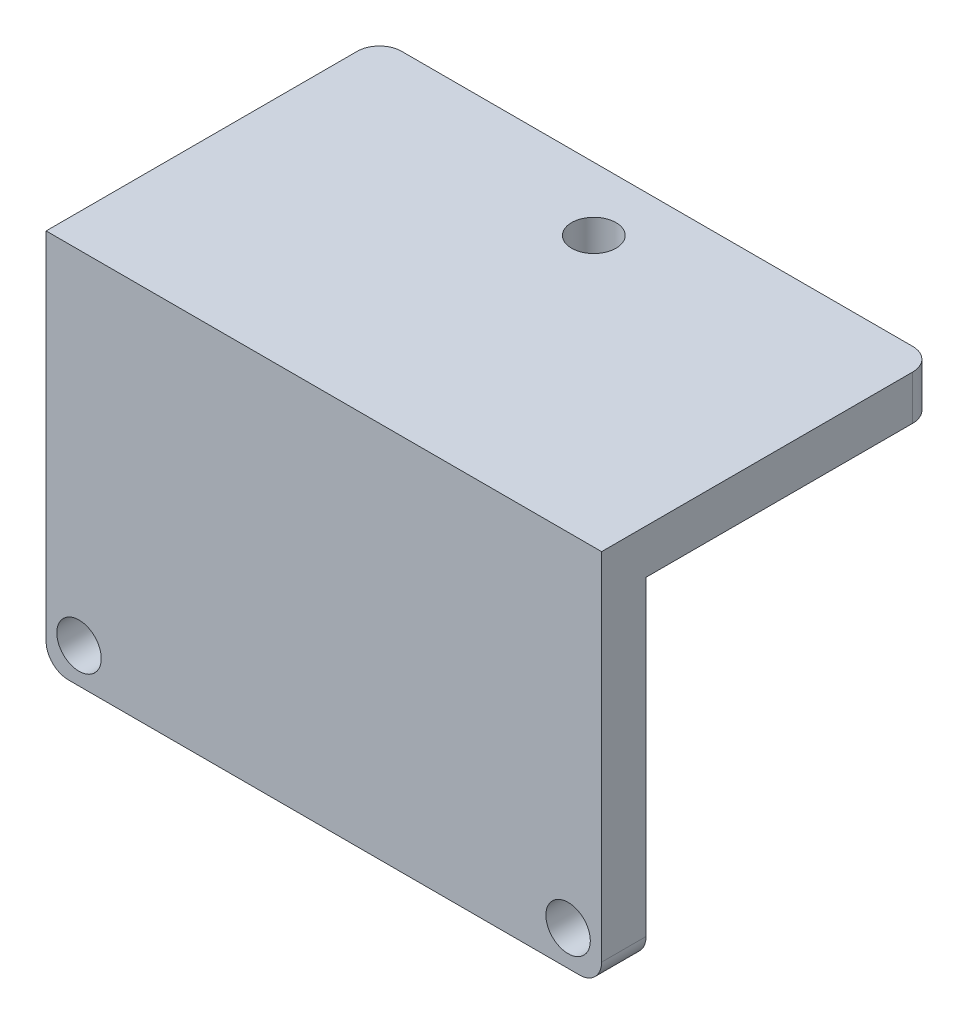
ISO-10303-21;
HEADER;
FILE_DESCRIPTION(('STEP AP214'),'2;1');
FILE_NAME('part.step','',(''),(''),'','','');
FILE_SCHEMA(('AUTOMOTIVE_DESIGN { 1 0 10303 214 1 1 1 1 }'));
ENDSEC;
DATA;
#1=APPLICATION_CONTEXT('core data for automotive mechanical design processes');
#2=APPLICATION_PROTOCOL_DEFINITION('international standard','automotive_design',2000,#1);
#3=PRODUCT_CONTEXT('',#1,'mechanical');
#4=PRODUCT('Part','Part','',(#3));
#5=PRODUCT_RELATED_PRODUCT_CATEGORY('part','',(#4));
#6=PRODUCT_DEFINITION_FORMATION('','',#4);
#7=PRODUCT_DEFINITION_CONTEXT('part definition',#1,'design');
#8=PRODUCT_DEFINITION('design','',#6,#7);
#9=PRODUCT_DEFINITION_SHAPE('','',#8);
#10=(LENGTH_UNIT() NAMED_UNIT(*) SI_UNIT(.MILLI.,.METRE.));
#11=(NAMED_UNIT(*) PLANE_ANGLE_UNIT() SI_UNIT($,.RADIAN.));
#12=(NAMED_UNIT(*) SI_UNIT($,.STERADIAN.) SOLID_ANGLE_UNIT());
#13=UNCERTAINTY_MEASURE_WITH_UNIT(LENGTH_MEASURE(1.E-05),#10,'distance_accuracy_value','');
#14=(GEOMETRIC_REPRESENTATION_CONTEXT(3) GLOBAL_UNCERTAINTY_ASSIGNED_CONTEXT((#13)) GLOBAL_UNIT_ASSIGNED_CONTEXT((#10,
#11,#12)) REPRESENTATION_CONTEXT('',''));
#15=CARTESIAN_POINT('',(0.,0.,0.));
#16=DIRECTION('',(0.,0.,1.));
#17=DIRECTION('',(1.,0.,0.));
#18=AXIS2_PLACEMENT_3D('',#15,#16,#17);
#19=CARTESIAN_POINT('',(0.,0.,2.));
#20=DIRECTION('',(0.,0.,-1.));
#21=DIRECTION('',(-1.,0.,0.));
#22=AXIS2_PLACEMENT_3D('',#19,#20,#21);
#23=PLANE('',#22);
#24=DIRECTION('',(0.,-1.,0.));
#25=VECTOR('',#24,1.);
#26=CARTESIAN_POINT('',(-25.,0.,2.));
#27=LINE('',#26,#25);
#28=CARTESIAN_POINT('',(-25.,2.,2.));
#29=VERTEX_POINT('',#28);
#30=CARTESIAN_POINT('',(-25.,-14.,2.));
#31=VERTEX_POINT('',#30);
#32=EDGE_CURVE('E137',#29,#31,#27,.T.);
#33=ORIENTED_EDGE('',*,*,#32,.T.);
#34=CARTESIAN_POINT('',(-25.,-14.,2.));
#35=CARTESIAN_POINT('',(-24.9999997996185,-14.028134745567,2.));
#36=CARTESIAN_POINT('',(-24.9988119032098,-14.0562560017053,2.));
#37=CARTESIAN_POINT('',(-24.9940728849558,-14.1122973163283,2.));
#38=CARTESIAN_POINT('',(-24.9905218736389,-14.1402173841614,2.));
#39=CARTESIAN_POINT('',(-24.9763578457215,-14.2233269372849,2.));
#40=CARTESIAN_POINT('',(-24.9622337417672,-14.2779597520746,2.));
#41=CARTESIAN_POINT('',(-24.9250149037354,-14.3840769200263,2.));
#42=CARTESIAN_POINT('',(-24.9019158622525,-14.4355597476392,2.));
#43=CARTESIAN_POINT('',(-24.8474030418845,-14.5339160760032,2.));
#44=CARTESIAN_POINT('',(-24.8159907277454,-14.5807903867524,2.));
#45=CARTESIAN_POINT('',(-24.7457470917003,-14.6685994578614,2.));
#46=CARTESIAN_POINT('',(-24.7069150570088,-14.7095336469101,2.));
#47=CARTESIAN_POINT('',(-24.6229041961312,-14.7843139872613,2.));
#48=CARTESIAN_POINT('',(-24.5777254722674,-14.8181602528144,2.));
#49=CARTESIAN_POINT('',(-24.5062109947204,-14.8628702542628,2.));
#50=CARTESIAN_POINT('',(-24.4817269025462,-14.8767725615212,2.));
#51=CARTESIAN_POINT('',(-24.4316995735737,-14.9024553813564,2.));
#52=CARTESIAN_POINT('',(-24.4061572983413,-14.9142377704311,2.));
#53=CARTESIAN_POINT('',(-24.3281796273028,-14.9462808360317,2.));
#54=CARTESIAN_POINT('',(-24.2743436000231,-14.9632684766767,2.));
#55=CARTESIAN_POINT('',(-24.1834905911766,-14.9837173856166,2.));
#56=CARTESIAN_POINT('',(-24.147036002075,-14.9898193941278,2.));
#57=CARTESIAN_POINT('',(-24.0737283254992,-14.9979590428387,2.));
#58=CARTESIAN_POINT('',(-24.0368758777553,-15.0000024450033,2.));
#59=CARTESIAN_POINT('',(-24.,-15.,2.));
#60=B_SPLINE_CURVE_WITH_KNOTS('',3,(#34,#35,#36,#37,#38,#39,#40,#41,#42,#43,#44,#45,#46,#47,#48,
#49,#50,#51,#52,#53,#54,#55,#56,#57,#58,#59),.UNSPECIFIED.,.F.,.F.,(4,2,2,2,2,2,2,2,2,2,2,2,4),
(0.,0.0843523719680451,0.168700798857648,0.33711930117993,0.50561873383297,0.674088497696919,
0.842574453982343,1.01105769422312,1.09543727445699,1.179741792573,1.34817695086741,
1.45885920377357,1.56938420949917),.UNSPECIFIED.);
#61=CARTESIAN_POINT('',(-24.,-15.,2.));
#62=VERTEX_POINT('',#61);
#63=EDGE_CURVE('E313',#31,#62,#60,.T.);
#64=ORIENTED_EDGE('',*,*,#63,.T.);
#65=DIRECTION('',(1.,0.,0.));
#66=VECTOR('',#65,1.);
#67=CARTESIAN_POINT('',(0.,-15.,2.));
#68=LINE('',#67,#66);
#69=CARTESIAN_POINT('',(-0.999999999999998,-15.,2.));
#70=VERTEX_POINT('',#69);
#71=EDGE_CURVE('E144',#62,#70,#68,.T.);
#72=ORIENTED_EDGE('',*,*,#71,.T.);
#73=CARTESIAN_POINT('',(-0.999999999999998,-15.,2.));
#74=CARTESIAN_POINT('',(-0.97186525443297,-14.9999997996185,2.));
#75=CARTESIAN_POINT('',(-0.943743998294749,-14.9988119032098,2.));
#76=CARTESIAN_POINT('',(-0.887702683671729,-14.9940728849558,2.));
#77=CARTESIAN_POINT('',(-0.859782615838623,-14.9905218736389,2.));
#78=CARTESIAN_POINT('',(-0.776673062715144,-14.9763578457214,2.));
#79=CARTESIAN_POINT('',(-0.722040247925385,-14.9622337417672,2.));
#80=CARTESIAN_POINT('',(-0.615923079973703,-14.9250149037354,2.));
#81=CARTESIAN_POINT('',(-0.56444025236083,-14.9019158622525,2.));
#82=CARTESIAN_POINT('',(-0.466083923996784,-14.8474030418845,2.));
#83=CARTESIAN_POINT('',(-0.419209613247622,-14.8159907277453,2.));
#84=CARTESIAN_POINT('',(-0.331400542138594,-14.7457470917003,2.));
#85=CARTESIAN_POINT('',(-0.290466353089881,-14.7069150570088,2.));
#86=CARTESIAN_POINT('',(-0.215686012738719,-14.6229041961312,2.));
#87=CARTESIAN_POINT('',(-0.181839747185592,-14.5777254722674,2.));
#88=CARTESIAN_POINT('',(-0.137129745737251,-14.5062109947204,2.));
#89=CARTESIAN_POINT('',(-0.123227438478842,-14.4817269025462,2.));
#90=CARTESIAN_POINT('',(-0.0975446186435505,-14.4316995735737,2.));
#91=CARTESIAN_POINT('',(-0.08576222956887,-14.4061572983413,2.));
#92=CARTESIAN_POINT('',(-0.0537191639682927,-14.3281796273028,2.));
#93=CARTESIAN_POINT('',(-0.0367315233233388,-14.2743436000231,2.));
#94=CARTESIAN_POINT('',(-0.0162826143833987,-14.1834905911766,2.));
#95=CARTESIAN_POINT('',(-0.0101806058722224,-14.147036002075,2.));
#96=CARTESIAN_POINT('',(-0.00204095716132224,-14.0737283254992,2.));
#97=CARTESIAN_POINT('',(2.44500328721798E-06,-14.0368758777553,2.));
#98=CARTESIAN_POINT('',(0.,-14.,2.));
#99=B_SPLINE_CURVE_WITH_KNOTS('',3,(#73,#74,#75,#76,#77,#78,#79,#80,#81,#82,#83,#84,#85,#86,#87,
#88,#89,#90,#91,#92,#93,#94,#95,#96,#97,#98),.UNSPECIFIED.,.F.,.F.,(4,2,2,2,2,2,2,2,2,2,2,2,4),
(0.,0.0843523719680458,0.168700798857649,0.33711930117993,0.505618733832968,0.67408849769692,
0.842574453982342,1.01105769422312,1.09543727445699,1.17974179257301,1.34817695086743,
1.45885920377359,1.56938420949918),.UNSPECIFIED.);
#100=CARTESIAN_POINT('',(0.,-14.,2.));
#101=VERTEX_POINT('',#100);
#102=EDGE_CURVE('E253',#70,#101,#99,.T.);
#103=ORIENTED_EDGE('',*,*,#102,.T.);
#104=DIRECTION('',(0.,1.,0.));
#105=VECTOR('',#104,1.);
#106=CARTESIAN_POINT('',(0.,0.,2.));
#107=LINE('',#106,#105);
#108=CARTESIAN_POINT('',(0.,2.,2.));
#109=VERTEX_POINT('',#108);
#110=EDGE_CURVE('E145',#101,#109,#107,.T.);
#111=ORIENTED_EDGE('',*,*,#110,.T.);
#112=DIRECTION('',(1.,0.,0.));
#113=VECTOR('',#112,1.);
#114=CARTESIAN_POINT('',(-25.,2.,2.));
#115=LINE('',#114,#113);
#116=EDGE_CURVE('E128',#29,#109,#115,.T.);
#117=ORIENTED_EDGE('',*,*,#116,.F.);
#118=EDGE_LOOP('',(#33,#64,#72,#103,#111,#117));
#119=FACE_BOUND('',#118,.T.);
#120=CARTESIAN_POINT('',(-23.5193155415756,-13.4230684262862,2.));
#121=DIRECTION('',(0.,0.,1.));
#122=DIRECTION('',(1.,0.,0.));
#123=AXIS2_PLACEMENT_3D('',#120,#121,#122);
#124=CIRCLE('',#123,1.);
#125=CARTESIAN_POINT('',(-22.5193155415756,-13.4230684262862,2.));
#126=VERTEX_POINT('',#125);
#127=EDGE_CURVE('E169',#126,#126,#124,.T.);
#128=ORIENTED_EDGE('',*,*,#127,.F.);
#129=EDGE_LOOP('',(#128));
#130=FACE_BOUND('',#129,.T.);
#131=CARTESIAN_POINT('',(-1.50821061141534,-13.4230684262862,2.));
#132=DIRECTION('',(0.,0.,1.));
#133=DIRECTION('',(1.,0.,0.));
#134=AXIS2_PLACEMENT_3D('',#131,#132,#133);
#135=CIRCLE('',#134,1.);
#136=CARTESIAN_POINT('',(-0.508210611415337,-13.4230684262862,2.));
#137=VERTEX_POINT('',#136);
#138=EDGE_CURVE('E163',#137,#137,#135,.T.);
#139=ORIENTED_EDGE('',*,*,#138,.F.);
#140=EDGE_LOOP('',(#139));
#141=FACE_BOUND('',#140,.T.);
#142=ADVANCED_FACE('F38',(#119,#130,#141),#23,.F.);
#143=CARTESIAN_POINT('',(0.,0.,0.));
#144=DIRECTION('',(0.,0.,-1.));
#145=DIRECTION('',(-1.,0.,0.));
#146=AXIS2_PLACEMENT_3D('',#143,#144,#145);
#147=PLANE('',#146);
#148=CARTESIAN_POINT('',(-23.5193155415756,-13.4230684262862,0.));
#149=DIRECTION('',(0.,0.,1.));
#150=DIRECTION('',(1.,0.,0.));
#151=AXIS2_PLACEMENT_3D('',#148,#149,#150);
#152=CIRCLE('',#151,1.);
#153=CARTESIAN_POINT('',(-22.5193155415756,-13.4230684262862,0.));
#154=VERTEX_POINT('',#153);
#155=EDGE_CURVE('E166',#154,#154,#152,.T.);
#156=ORIENTED_EDGE('',*,*,#155,.T.);
#157=EDGE_LOOP('',(#156));
#158=FACE_BOUND('',#157,.T.);
#159=DIRECTION('',(1.,0.,0.));
#160=VECTOR('',#159,1.);
#161=CARTESIAN_POINT('',(0.,-15.,0.));
#162=LINE('',#161,#160);
#163=CARTESIAN_POINT('',(-24.,-15.,0.));
#164=VERTEX_POINT('',#163);
#165=CARTESIAN_POINT('',(-0.999999999999998,-15.,0.));
#166=VERTEX_POINT('',#165);
#167=EDGE_CURVE('E175',#164,#166,#162,.T.);
#168=ORIENTED_EDGE('',*,*,#167,.F.);
#169=CARTESIAN_POINT('',(-24.,-15.,0.));
#170=CARTESIAN_POINT('',(-24.028134745567,-14.9999997996185,0.));
#171=CARTESIAN_POINT('',(-24.0562560017053,-14.9988119032098,0.));
#172=CARTESIAN_POINT('',(-24.1122973163283,-14.9940728849558,0.));
#173=CARTESIAN_POINT('',(-24.1402173841614,-14.9905218736389,0.));
#174=CARTESIAN_POINT('',(-24.2233269372849,-14.9763578457214,0.));
#175=CARTESIAN_POINT('',(-24.2779597520746,-14.9622337417672,0.));
#176=CARTESIAN_POINT('',(-24.3840769200263,-14.9250149037354,0.));
#177=CARTESIAN_POINT('',(-24.4355597476392,-14.9019158622525,0.));
#178=CARTESIAN_POINT('',(-24.5339160760032,-14.8474030418845,0.));
#179=CARTESIAN_POINT('',(-24.5807903867524,-14.8159907277453,0.));
#180=CARTESIAN_POINT('',(-24.6685994578614,-14.7457470917003,0.));
#181=CARTESIAN_POINT('',(-24.7095336469101,-14.7069150570088,0.));
#182=CARTESIAN_POINT('',(-24.7843139872613,-14.6229041961312,0.));
#183=CARTESIAN_POINT('',(-24.8181602528144,-14.5777254722674,0.));
#184=CARTESIAN_POINT('',(-24.8628702542628,-14.5062109947204,0.));
#185=CARTESIAN_POINT('',(-24.8767725615212,-14.4817269025462,0.));
#186=CARTESIAN_POINT('',(-24.9024553813565,-14.4316995735737,0.));
#187=CARTESIAN_POINT('',(-24.9142377704311,-14.4061572983413,0.));
#188=CARTESIAN_POINT('',(-24.9462808360317,-14.3281796273028,0.));
#189=CARTESIAN_POINT('',(-24.9632684766767,-14.2743436000231,0.));
#190=CARTESIAN_POINT('',(-24.9837173856166,-14.1834905911766,0.));
#191=CARTESIAN_POINT('',(-24.9898193941278,-14.147036002075,0.));
#192=CARTESIAN_POINT('',(-24.9979590428387,-14.0737283254992,0.));
#193=CARTESIAN_POINT('',(-25.0000024450033,-14.0368758777553,0.));
#194=CARTESIAN_POINT('',(-25.,-14.,0.));
#195=B_SPLINE_CURVE_WITH_KNOTS('',3,(#169,#170,#171,#172,#173,#174,#175,#176,#177,#178,#179,
#180,#181,#182,#183,#184,#185,#186,#187,#188,#189,#190,#191,#192,#193,#194),.UNSPECIFIED.,.F.,
.F.,(4,2,2,2,2,2,2,2,2,2,2,2,4),(0.,0.0843523719680469,0.168700798857652,0.337119301179937,
0.50561873383298,0.674088497696934,0.842574453982358,1.01105769422313,1.095437274457,
1.17974179257302,1.34817695086744,1.45885920377359,1.56938420949918),.UNSPECIFIED.);
#196=CARTESIAN_POINT('',(-25.,-14.,0.));
#197=VERTEX_POINT('',#196);
#198=EDGE_CURVE('E210',#164,#197,#195,.T.);
#199=ORIENTED_EDGE('',*,*,#198,.T.);
#200=DIRECTION('',(0.,-1.,0.));
#201=VECTOR('',#200,1.);
#202=CARTESIAN_POINT('',(-25.,0.,0.));
#203=LINE('',#202,#201);
#204=CARTESIAN_POINT('',(-25.,0.,0.));
#205=VERTEX_POINT('',#204);
#206=EDGE_CURVE('E184',#205,#197,#203,.T.);
#207=ORIENTED_EDGE('',*,*,#206,.F.);
#208=DIRECTION('',(-1.,0.,0.));
#209=VECTOR('',#208,1.);
#210=CARTESIAN_POINT('',(0.,0.,0.));
#211=LINE('',#210,#209);
#212=CARTESIAN_POINT('',(0.,0.,0.));
#213=VERTEX_POINT('',#212);
#214=EDGE_CURVE('E181',#213,#205,#211,.T.);
#215=ORIENTED_EDGE('',*,*,#214,.F.);
#216=DIRECTION('',(0.,1.,0.));
#217=VECTOR('',#216,1.);
#218=CARTESIAN_POINT('',(0.,0.,0.));
#219=LINE('',#218,#217);
#220=CARTESIAN_POINT('',(0.,-14.,0.));
#221=VERTEX_POINT('',#220);
#222=EDGE_CURVE('E172',#221,#213,#219,.T.);
#223=ORIENTED_EDGE('',*,*,#222,.F.);
#224=CARTESIAN_POINT('',(0.,-14.,0.));
#225=CARTESIAN_POINT('',(-2.00381546555757E-07,-14.028134745567,0.));
#226=CARTESIAN_POINT('',(-0.00118809679022327,-14.0562560017052,0.));
#227=CARTESIAN_POINT('',(-0.0059271150441788,-14.1122973163283,0.));
#228=CARTESIAN_POINT('',(-0.00947812636110279,-14.1402173841614,0.));
#229=CARTESIAN_POINT('',(-0.0236421542785576,-14.2233269372849,0.));
#230=CARTESIAN_POINT('',(-0.0377662582328379,-14.2779597520746,0.));
#231=CARTESIAN_POINT('',(-0.0749850962645588,-14.3840769200263,0.));
#232=CARTESIAN_POINT('',(-0.0980841377474982,-14.4355597476392,0.));
#233=CARTESIAN_POINT('',(-0.152596958115516,-14.5339160760032,0.));
#234=CARTESIAN_POINT('',(-0.184009272254659,-14.5807903867524,0.));
#235=CARTESIAN_POINT('',(-0.254252908299716,-14.6685994578614,0.));
#236=CARTESIAN_POINT('',(-0.293084942991177,-14.7095336469101,0.));
#237=CARTESIAN_POINT('',(-0.377095803868763,-14.7843139872613,0.));
#238=CARTESIAN_POINT('',(-0.422274527732596,-14.8181602528144,0.));
#239=CARTESIAN_POINT('',(-0.493789005279561,-14.8628702542627,0.));
#240=CARTESIAN_POINT('',(-0.518273097453774,-14.8767725615212,0.));
#241=CARTESIAN_POINT('',(-0.568300426426299,-14.9024553813564,0.));
#242=CARTESIAN_POINT('',(-0.593842701658704,-14.9142377704311,0.));
#243=CARTESIAN_POINT('',(-0.671820372697227,-14.9462808360317,0.));
#244=CARTESIAN_POINT('',(-0.725656399976934,-14.9632684766767,0.));
#245=CARTESIAN_POINT('',(-0.816509408823389,-14.9837173856166,0.));
#246=CARTESIAN_POINT('',(-0.852963997925003,-14.9898193941278,0.));
#247=CARTESIAN_POINT('',(-0.92627167450077,-14.9979590428387,0.));
#248=CARTESIAN_POINT('',(-0.963124122244662,-15.0000024450033,0.));
#249=CARTESIAN_POINT('',(-0.999999999999998,-15.,0.));
#250=B_SPLINE_CURVE_WITH_KNOTS('',3,(#224,#225,#226,#227,#228,#229,#230,#231,#232,#233,#234,
#235,#236,#237,#238,#239,#240,#241,#242,#243,#244,#245,#246,#247,#248,#249),.UNSPECIFIED.,.F.,
.F.,(4,2,2,2,2,2,2,2,2,2,2,2,4),(0.,0.084352371968045,0.168700798857648,0.337119301179932,
0.505618733832971,0.674088497696921,0.842574453982343,1.01105769422312,1.09543727445699,
1.17974179257301,1.34817695086743,1.45885920377358,1.56938420949918),.UNSPECIFIED.);
#251=EDGE_CURVE('E199',#221,#166,#250,.T.);
#252=ORIENTED_EDGE('',*,*,#251,.T.);
#253=EDGE_LOOP('',(#168,#199,#207,#215,#223,#252));
#254=FACE_BOUND('',#253,.T.);
#255=CARTESIAN_POINT('',(-1.50821061141534,-13.4230684262862,0.));
#256=DIRECTION('',(0.,0.,1.));
#257=DIRECTION('',(1.,0.,0.));
#258=AXIS2_PLACEMENT_3D('',#255,#256,#257);
#259=CIRCLE('',#258,1.);
#260=CARTESIAN_POINT('',(-0.508210611415337,-13.4230684262862,0.));
#261=VERTEX_POINT('',#260);
#262=EDGE_CURVE('E156',#261,#261,#259,.T.);
#263=ORIENTED_EDGE('',*,*,#262,.T.);
#264=EDGE_LOOP('',(#263));
#265=FACE_BOUND('',#264,.T.);
#266=ADVANCED_FACE('F217',(#158,#254,#265),#147,.T.);
#267=CARTESIAN_POINT('',(0.,0.,2.));
#268=DIRECTION('',(-1.,0.,0.));
#269=DIRECTION('',(0.,-1.,0.));
#270=AXIS2_PLACEMENT_3D('',#267,#268,#269);
#271=PLANE('',#270);
#272=DIRECTION('',(0.,0.,-1.));
#273=VECTOR('',#272,1.);
#274=CARTESIAN_POINT('',(0.,0.,2.));
#275=LINE('',#274,#273);
#276=CARTESIAN_POINT('',(0.,0.,-12.));
#277=VERTEX_POINT('',#276);
#278=EDGE_CURVE('E159',#213,#277,#275,.T.);
#279=ORIENTED_EDGE('',*,*,#278,.T.);
#280=CARTESIAN_POINT('',(0.,6.,-12.));
#281=CARTESIAN_POINT('',(0.,4.66666666666667,-12.));
#282=CARTESIAN_POINT('',(0.,3.33333333333333,-12.));
#283=CARTESIAN_POINT('',(0.,2.,-12.));
#284=CARTESIAN_POINT('',(0.,1.33333333333333,-12.));
#285=CARTESIAN_POINT('',(0.,0.666666666666667,-12.));
#286=CARTESIAN_POINT('',(0.,0.,-12.));
#287=CARTESIAN_POINT('',(0.,-1.33333333333333,-12.));
#288=CARTESIAN_POINT('',(0.,-2.66666666666667,-12.));
#289=CARTESIAN_POINT('',(0.,-4.,-12.));
#290=(BOUNDED_CURVE() B_SPLINE_CURVE(3,(#280,#281,#282,#283,#284,#285,#286,#287,#288,#289),
.UNSPECIFIED.,.F.,.F.) B_SPLINE_CURVE_WITH_KNOTS((4,3,3,4),(-0.004,0.,0.002,0.006),
.UNSPECIFIED.) CURVE() GEOMETRIC_REPRESENTATION_ITEM() RATIONAL_B_SPLINE_CURVE((1.,1.,1.,1.,1.,
1.,1.,1.,1.,1.)) REPRESENTATION_ITEM(''));
#291=CARTESIAN_POINT('',(0.,2.,-12.));
#292=VERTEX_POINT('',#291);
#293=EDGE_CURVE('E55',#277,#292,#290,.F.);
#294=ORIENTED_EDGE('',*,*,#293,.T.);
#295=DIRECTION('',(0.,0.,-1.));
#296=VECTOR('',#295,1.);
#297=CARTESIAN_POINT('',(0.,2.,2.));
#298=LINE('',#297,#296);
#299=EDGE_CURVE('E149',#109,#292,#298,.T.);
#300=ORIENTED_EDGE('',*,*,#299,.F.);
#301=ORIENTED_EDGE('',*,*,#110,.F.);
#302=CARTESIAN_POINT('',(0.,-14.,6.));
#303=CARTESIAN_POINT('',(0.,-14.,4.66666666666667));
#304=CARTESIAN_POINT('',(0.,-14.,3.33333333333333));
#305=CARTESIAN_POINT('',(0.,-14.,2.));
#306=CARTESIAN_POINT('',(0.,-14.,1.33333333333333));
#307=CARTESIAN_POINT('',(0.,-14.,0.666666666666668));
#308=CARTESIAN_POINT('',(0.,-14.,0.));
#309=CARTESIAN_POINT('',(0.,-14.,-1.33333333333333));
#310=CARTESIAN_POINT('',(0.,-14.,-2.66666666666667));
#311=CARTESIAN_POINT('',(0.,-14.,-4.));
#312=(BOUNDED_CURVE() B_SPLINE_CURVE(3,(#302,#303,#304,#305,#306,#307,#308,#309,#310,#311),
.UNSPECIFIED.,.F.,.F.) B_SPLINE_CURVE_WITH_KNOTS((4,3,3,4),(-0.004,0.,0.002,0.006),
.UNSPECIFIED.) CURVE() GEOMETRIC_REPRESENTATION_ITEM() RATIONAL_B_SPLINE_CURVE((1.,1.,1.,1.,1.,
1.,1.,1.,1.,1.)) REPRESENTATION_ITEM(''));
#313=EDGE_CURVE('E387',#101,#221,#312,.T.);
#314=ORIENTED_EDGE('',*,*,#313,.T.);
#315=ORIENTED_EDGE('',*,*,#222,.T.);
#316=EDGE_LOOP('',(#279,#294,#300,#301,#314,#315));
#317=FACE_BOUND('',#316,.T.);
#318=ADVANCED_FACE('F412',(#317),#271,.F.);
#319=CARTESIAN_POINT('',(-25.,0.,2.));
#320=DIRECTION('',(1.,0.,0.));
#321=DIRECTION('',(0.,1.,0.));
#322=AXIS2_PLACEMENT_3D('',#319,#320,#321);
#323=PLANE('',#322);
#324=DIRECTION('',(0.,0.,1.));
#325=VECTOR('',#324,1.);
#326=CARTESIAN_POINT('',(-25.,2.,-13.));
#327=LINE('',#326,#325);
#328=CARTESIAN_POINT('',(-25.,2.,-12.));
#329=VERTEX_POINT('',#328);
#330=EDGE_CURVE('E124',#329,#29,#327,.T.);
#331=ORIENTED_EDGE('',*,*,#330,.F.);
#332=CARTESIAN_POINT('',(-25.,6.,-12.));
#333=CARTESIAN_POINT('',(-25.,4.66666666666667,-12.));
#334=CARTESIAN_POINT('',(-25.,3.33333333333333,-12.));
#335=CARTESIAN_POINT('',(-25.,2.,-12.));
#336=CARTESIAN_POINT('',(-25.,1.33333333333333,-12.));
#337=CARTESIAN_POINT('',(-25.,0.666666666666668,-12.));
#338=CARTESIAN_POINT('',(-25.,0.,-12.));
#339=CARTESIAN_POINT('',(-25.,-1.33333333333333,-12.));
#340=CARTESIAN_POINT('',(-25.,-2.66666666666667,-12.));
#341=CARTESIAN_POINT('',(-25.,-4.,-12.));
#342=(BOUNDED_CURVE() B_SPLINE_CURVE(3,(#332,#333,#334,#335,#336,#337,#338,#339,#340,#341),
.UNSPECIFIED.,.F.,.F.) B_SPLINE_CURVE_WITH_KNOTS((4,3,3,4),(-0.004,0.,0.002,0.006),
.UNSPECIFIED.) CURVE() GEOMETRIC_REPRESENTATION_ITEM() RATIONAL_B_SPLINE_CURVE((1.,1.,1.,1.,1.,
1.,1.,1.,1.,1.)) REPRESENTATION_ITEM(''));
#343=CARTESIAN_POINT('',(-25.,0.,-12.));
#344=VERTEX_POINT('',#343);
#345=EDGE_CURVE('E385',#329,#344,#342,.T.);
#346=ORIENTED_EDGE('',*,*,#345,.T.);
#347=DIRECTION('',(0.,0.,1.));
#348=VECTOR('',#347,1.);
#349=CARTESIAN_POINT('',(-25.,0.,-13.));
#350=LINE('',#349,#348);
#351=EDGE_CURVE('E157',#344,#205,#350,.T.);
#352=ORIENTED_EDGE('',*,*,#351,.T.);
#353=ORIENTED_EDGE('',*,*,#206,.T.);
#354=CARTESIAN_POINT('',(-25.,-14.,6.));
#355=CARTESIAN_POINT('',(-25.,-14.,4.66666666666667));
#356=CARTESIAN_POINT('',(-25.,-14.,3.33333333333333));
#357=CARTESIAN_POINT('',(-25.,-14.,2.));
#358=CARTESIAN_POINT('',(-25.,-14.,1.33333333333333));
#359=CARTESIAN_POINT('',(-25.,-14.,0.666666666666667));
#360=CARTESIAN_POINT('',(-25.,-14.,0.));
#361=CARTESIAN_POINT('',(-25.,-14.,-1.33333333333333));
#362=CARTESIAN_POINT('',(-25.,-14.,-2.66666666666667));
#363=CARTESIAN_POINT('',(-25.,-14.,-4.));
#364=(BOUNDED_CURVE() B_SPLINE_CURVE(3,(#354,#355,#356,#357,#358,#359,#360,#361,#362,#363),
.UNSPECIFIED.,.F.,.F.) B_SPLINE_CURVE_WITH_KNOTS((4,3,3,4),(-0.004,0.,0.002,0.006),
.UNSPECIFIED.) CURVE() GEOMETRIC_REPRESENTATION_ITEM() RATIONAL_B_SPLINE_CURVE((1.,1.,1.,1.,1.,
1.,1.,1.,1.,1.)) REPRESENTATION_ITEM(''));
#365=EDGE_CURVE('E141',#197,#31,#364,.F.);
#366=ORIENTED_EDGE('',*,*,#365,.T.);
#367=ORIENTED_EDGE('',*,*,#32,.F.);
#368=EDGE_LOOP('',(#331,#346,#352,#353,#366,#367));
#369=FACE_BOUND('',#368,.T.);
#370=ADVANCED_FACE('F138',(#369),#323,.F.);
#371=CARTESIAN_POINT('',(0.,-15.,2.));
#372=DIRECTION('',(0.,1.,0.));
#373=DIRECTION('',(-1.,0.,0.));
#374=AXIS2_PLACEMENT_3D('',#371,#372,#373);
#375=PLANE('',#374);
#376=ORIENTED_EDGE('',*,*,#71,.F.);
#377=CARTESIAN_POINT('',(-24.,-15.,6.));
#378=CARTESIAN_POINT('',(-24.,-15.,4.66666666666667));
#379=CARTESIAN_POINT('',(-24.,-15.,3.33333333333333));
#380=CARTESIAN_POINT('',(-24.,-15.,2.));
#381=CARTESIAN_POINT('',(-24.,-15.,1.33333333333333));
#382=CARTESIAN_POINT('',(-24.,-15.,0.666666666666667));
#383=CARTESIAN_POINT('',(-24.,-15.,0.));
#384=CARTESIAN_POINT('',(-24.,-15.,-1.33333333333333));
#385=CARTESIAN_POINT('',(-24.,-15.,-2.66666666666667));
#386=CARTESIAN_POINT('',(-24.,-15.,-4.));
#387=(BOUNDED_CURVE() B_SPLINE_CURVE(3,(#377,#378,#379,#380,#381,#382,#383,#384,#385,#386),
.UNSPECIFIED.,.F.,.F.) B_SPLINE_CURVE_WITH_KNOTS((4,3,3,4),(-0.004,0.,0.002,0.006),
.UNSPECIFIED.) CURVE() GEOMETRIC_REPRESENTATION_ITEM() RATIONAL_B_SPLINE_CURVE((1.,1.,1.,1.,1.,
1.,1.,1.,1.,1.)) REPRESENTATION_ITEM(''));
#388=EDGE_CURVE('E191',#62,#164,#387,.T.);
#389=ORIENTED_EDGE('',*,*,#388,.T.);
#390=ORIENTED_EDGE('',*,*,#167,.T.);
#391=CARTESIAN_POINT('',(-0.999999999999998,-15.,6.));
#392=CARTESIAN_POINT('',(-0.999999999999998,-15.,4.66666666666667));
#393=CARTESIAN_POINT('',(-0.999999999999998,-15.,3.33333333333333));
#394=CARTESIAN_POINT('',(-0.999999999999998,-15.,2.));
#395=CARTESIAN_POINT('',(-0.999999999999998,-15.,1.33333333333333));
#396=CARTESIAN_POINT('',(-0.999999999999998,-15.,0.666666666666667));
#397=CARTESIAN_POINT('',(-0.999999999999998,-15.,0.));
#398=CARTESIAN_POINT('',(-0.999999999999998,-15.,-1.33333333333333));
#399=CARTESIAN_POINT('',(-0.999999999999998,-15.,-2.66666666666667));
#400=CARTESIAN_POINT('',(-0.999999999999998,-15.,-4.));
#401=(BOUNDED_CURVE() B_SPLINE_CURVE(3,(#391,#392,#393,#394,#395,#396,#397,#398,#399,#400),
.UNSPECIFIED.,.F.,.F.) B_SPLINE_CURVE_WITH_KNOTS((4,3,3,4),(-0.004,0.,0.002,0.006),
.UNSPECIFIED.) CURVE() GEOMETRIC_REPRESENTATION_ITEM() RATIONAL_B_SPLINE_CURVE((1.,1.,1.,1.,1.,
1.,1.,1.,1.,1.)) REPRESENTATION_ITEM(''));
#402=EDGE_CURVE('E179',#166,#70,#401,.F.);
#403=ORIENTED_EDGE('',*,*,#402,.T.);
#404=EDGE_LOOP('',(#376,#389,#390,#403));
#405=FACE_BOUND('',#404,.T.);
#406=ADVANCED_FACE('F329',(#405),#375,.F.);
#407=CARTESIAN_POINT('',(-23.5193155415756,-13.4230684262862,2.));
#408=DIRECTION('',(0.,0.,-1.));
#409=DIRECTION('',(-1.,0.,0.));
#410=AXIS2_PLACEMENT_3D('',#407,#408,#409);
#411=CYLINDRICAL_SURFACE('',#410,1.);
#412=ORIENTED_EDGE('',*,*,#127,.T.);
#413=EDGE_LOOP('',(#412));
#414=FACE_BOUND('',#413,.T.);
#415=ORIENTED_EDGE('',*,*,#155,.F.);
#416=EDGE_LOOP('',(#415));
#417=FACE_BOUND('',#416,.T.);
#418=ADVANCED_FACE('F324',(#414,#417),#411,.F.);
#419=CARTESIAN_POINT('',(-1.50821061141534,-13.4230684262862,2.));
#420=DIRECTION('',(0.,0.,-1.));
#421=DIRECTION('',(-1.,0.,0.));
#422=AXIS2_PLACEMENT_3D('',#419,#420,#421);
#423=CYLINDRICAL_SURFACE('',#422,1.);
#424=ORIENTED_EDGE('',*,*,#138,.T.);
#425=EDGE_LOOP('',(#424));
#426=FACE_BOUND('',#425,.T.);
#427=ORIENTED_EDGE('',*,*,#262,.F.);
#428=EDGE_LOOP('',(#427));
#429=FACE_BOUND('',#428,.T.);
#430=ADVANCED_FACE('F328',(#426,#429),#423,.F.);
#431=CARTESIAN_POINT('',(-24.,-15.,2.4));
#432=CARTESIAN_POINT('',(-24.,-15.,2.26666666666667));
#433=CARTESIAN_POINT('',(-24.,-15.,2.13333333333333));
#434=CARTESIAN_POINT('',(-24.,-15.,2.));
#435=CARTESIAN_POINT('',(-24.,-15.,1.33333333333333));
#436=CARTESIAN_POINT('',(-24.,-15.,0.666666666666667));
#437=CARTESIAN_POINT('',(-24.,-15.,0.));
#438=CARTESIAN_POINT('',(-24.,-15.,-0.133333333333333));
#439=CARTESIAN_POINT('',(-24.,-15.,-0.266666666666667));
#440=CARTESIAN_POINT('',(-24.,-15.,-0.4));
#441=CARTESIAN_POINT('',(-25.,-15.,2.4));
#442=CARTESIAN_POINT('',(-25.,-15.,2.26666666666667));
#443=CARTESIAN_POINT('',(-25.,-15.,2.13333333333333));
#444=CARTESIAN_POINT('',(-25.,-15.,2.));
#445=CARTESIAN_POINT('',(-25.,-15.,1.33333333333333));
#446=CARTESIAN_POINT('',(-25.,-15.,0.666666666666667));
#447=CARTESIAN_POINT('',(-25.,-15.,0.));
#448=CARTESIAN_POINT('',(-25.,-15.,-0.133333333333333));
#449=CARTESIAN_POINT('',(-25.,-15.,-0.266666666666667));
#450=CARTESIAN_POINT('',(-25.,-15.,-0.4));
#451=CARTESIAN_POINT('',(-25.,-14.,2.4));
#452=CARTESIAN_POINT('',(-25.,-14.,2.26666666666667));
#453=CARTESIAN_POINT('',(-25.,-14.,2.13333333333333));
#454=CARTESIAN_POINT('',(-25.,-14.,2.));
#455=CARTESIAN_POINT('',(-25.,-14.,1.33333333333333));
#456=CARTESIAN_POINT('',(-25.,-14.,0.666666666666667));
#457=CARTESIAN_POINT('',(-25.,-14.,0.));
#458=CARTESIAN_POINT('',(-25.,-14.,-0.133333333333333));
#459=CARTESIAN_POINT('',(-25.,-14.,-0.266666666666667));
#460=CARTESIAN_POINT('',(-25.,-14.,-0.4));
#461=(BOUNDED_SURFACE() B_SPLINE_SURFACE(2,3,((#431,#432,#433,#434,#435,#436,#437,#438,#439,
#440),(#441,#442,#443,#444,#445,#446,#447,#448,#449,#450),(#451,#452,#453,#454,#455,#456,#457,
#458,#459,#460)),.UNSPECIFIED.,.F.,.F.,.F.) B_SPLINE_SURFACE_WITH_KNOTS((3,3),(4,3,3,4),(0.,1.),
(-0.000400000000000001,0.,0.002,0.0024),
.UNSPECIFIED.) GEOMETRIC_REPRESENTATION_ITEM() RATIONAL_B_SPLINE_SURFACE(((1.,1.,1.,1.,1.,1.,1.,
1.,1.,1.),(0.707106781186548,0.707106781186548,0.707106781186548,0.707106781186548,
0.707106781186548,0.707106781186548,0.707106781186548,0.707106781186548,0.707106781186548,
0.707106781186548),(1.,1.,1.,1.,1.,1.,1.,1.,1.,1.))) REPRESENTATION_ITEM('') SURFACE());
#462=ORIENTED_EDGE('',*,*,#63,.F.);
#463=ORIENTED_EDGE('',*,*,#365,.F.);
#464=ORIENTED_EDGE('',*,*,#198,.F.);
#465=ORIENTED_EDGE('',*,*,#388,.F.);
#466=EDGE_LOOP('',(#462,#463,#464,#465));
#467=FACE_BOUND('',#466,.T.);
#468=ADVANCED_FACE('F232',(#467),#461,.T.);
#469=CARTESIAN_POINT('',(0.,-14.,2.4));
#470=CARTESIAN_POINT('',(0.,-14.,2.26666666666667));
#471=CARTESIAN_POINT('',(0.,-14.,2.13333333333333));
#472=CARTESIAN_POINT('',(0.,-14.,2.));
#473=CARTESIAN_POINT('',(0.,-14.,1.33333333333333));
#474=CARTESIAN_POINT('',(0.,-14.,0.666666666666668));
#475=CARTESIAN_POINT('',(0.,-14.,0.));
#476=CARTESIAN_POINT('',(0.,-14.,-0.133333333333333));
#477=CARTESIAN_POINT('',(0.,-14.,-0.266666666666667));
#478=CARTESIAN_POINT('',(0.,-14.,-0.400000000000001));
#479=CARTESIAN_POINT('',(0.,-15.,2.4));
#480=CARTESIAN_POINT('',(0.,-15.,2.26666666666667));
#481=CARTESIAN_POINT('',(0.,-15.,2.13333333333333));
#482=CARTESIAN_POINT('',(0.,-15.,2.));
#483=CARTESIAN_POINT('',(0.,-15.,1.33333333333333));
#484=CARTESIAN_POINT('',(0.,-15.,0.666666666666667));
#485=CARTESIAN_POINT('',(0.,-15.,0.));
#486=CARTESIAN_POINT('',(0.,-15.,-0.133333333333334));
#487=CARTESIAN_POINT('',(0.,-15.,-0.266666666666668));
#488=CARTESIAN_POINT('',(0.,-15.,-0.400000000000002));
#489=CARTESIAN_POINT('',(-0.999999999999998,-15.,2.4));
#490=CARTESIAN_POINT('',(-0.999999999999998,-15.,2.26666666666667));
#491=CARTESIAN_POINT('',(-0.999999999999998,-15.,2.13333333333333));
#492=CARTESIAN_POINT('',(-0.999999999999998,-15.,2.));
#493=CARTESIAN_POINT('',(-0.999999999999998,-15.,1.33333333333333));
#494=CARTESIAN_POINT('',(-0.999999999999998,-15.,0.666666666666667));
#495=CARTESIAN_POINT('',(-0.999999999999998,-15.,0.));
#496=CARTESIAN_POINT('',(-0.999999999999998,-15.,-0.133333333333334));
#497=CARTESIAN_POINT('',(-0.999999999999998,-15.,-0.266666666666668));
#498=CARTESIAN_POINT('',(-0.999999999999998,-15.,-0.400000000000002));
#499=(BOUNDED_SURFACE() B_SPLINE_SURFACE(2,3,((#469,#470,#471,#472,#473,#474,#475,#476,#477,
#478),(#479,#480,#481,#482,#483,#484,#485,#486,#487,#488),(#489,#490,#491,#492,#493,#494,#495,
#496,#497,#498)),.UNSPECIFIED.,.F.,.F.,.F.) B_SPLINE_SURFACE_WITH_KNOTS((3,3),(4,3,3,4),(0.,1.),
(-0.000400000000000001,0.,0.002,0.0024),
.UNSPECIFIED.) GEOMETRIC_REPRESENTATION_ITEM() RATIONAL_B_SPLINE_SURFACE(((1.,1.,1.,1.,1.,1.,1.,
1.,1.,1.),(0.707106781186548,0.707106781186548,0.707106781186548,0.707106781186548,
0.707106781186548,0.707106781186548,0.707106781186548,0.707106781186547,0.707106781186547,
0.707106781186547),(1.,1.,1.,1.,1.,1.,1.,1.,1.,1.))) REPRESENTATION_ITEM('') SURFACE());
#500=ORIENTED_EDGE('',*,*,#102,.F.);
#501=ORIENTED_EDGE('',*,*,#402,.F.);
#502=ORIENTED_EDGE('',*,*,#251,.F.);
#503=ORIENTED_EDGE('',*,*,#313,.F.);
#504=EDGE_LOOP('',(#500,#501,#502,#503));
#505=FACE_BOUND('',#504,.T.);
#506=ADVANCED_FACE('F222',(#505),#499,.T.);
#507=CARTESIAN_POINT('',(0.,0.,0.));
#508=DIRECTION('',(0.,1.,0.));
#509=DIRECTION('',(0.,0.,1.));
#510=AXIS2_PLACEMENT_3D('',#507,#508,#509);
#511=PLANE('',#510);
#512=CARTESIAN_POINT('',(-12.5,0.,-10.1481868614242));
#513=DIRECTION('',(0.,1.,0.));
#514=DIRECTION('',(0.,0.,1.));
#515=AXIS2_PLACEMENT_3D('',#512,#513,#514);
#516=CIRCLE('',#515,0.999999999999999);
#517=CARTESIAN_POINT('',(-12.5,0.,-9.14818686142424));
#518=VERTEX_POINT('',#517);
#519=EDGE_CURVE('E160',#518,#518,#516,.T.);
#520=ORIENTED_EDGE('',*,*,#519,.T.);
#521=EDGE_LOOP('',(#520));
#522=FACE_BOUND('',#521,.T.);
#523=DIRECTION('',(-1.,0.,0.));
#524=VECTOR('',#523,1.);
#525=CARTESIAN_POINT('',(0.,0.,-13.));
#526=LINE('',#525,#524);
#527=CARTESIAN_POINT('',(-1.,0.,-13.));
#528=VERTEX_POINT('',#527);
#529=CARTESIAN_POINT('',(-24.,0.,-13.));
#530=VERTEX_POINT('',#529);
#531=EDGE_CURVE('E134',#528,#530,#526,.T.);
#532=ORIENTED_EDGE('',*,*,#531,.F.);
#533=CARTESIAN_POINT('',(-1.,0.,-13.));
#534=CARTESIAN_POINT('',(-0.971865254432971,0.,-12.9999997996185));
#535=CARTESIAN_POINT('',(-0.94374399829475,0.,-12.9988119032098));
#536=CARTESIAN_POINT('',(-0.887702683671731,0.,-12.9940728849558));
#537=CARTESIAN_POINT('',(-0.859782615838624,0.,-12.9905218736389));
#538=CARTESIAN_POINT('',(-0.776673062715145,0.,-12.9763578457214));
#539=CARTESIAN_POINT('',(-0.722040247925386,0.,-12.9622337417672));
#540=CARTESIAN_POINT('',(-0.615923079973703,0.,-12.9250149037354));
#541=CARTESIAN_POINT('',(-0.564440252360829,0.,-12.9019158622525));
#542=CARTESIAN_POINT('',(-0.466083923996783,0.,-12.8474030418845));
#543=CARTESIAN_POINT('',(-0.419209613247623,0.,-12.8159907277453));
#544=CARTESIAN_POINT('',(-0.331400542138593,0.,-12.7457470917003));
#545=CARTESIAN_POINT('',(-0.290466353089878,0.,-12.7069150570088));
#546=CARTESIAN_POINT('',(-0.215686012738716,0.,-12.6229041961312));
#547=CARTESIAN_POINT('',(-0.181839747185592,0.,-12.5777254722674));
#548=CARTESIAN_POINT('',(-0.137129745737251,0.,-12.5062109947204));
#549=CARTESIAN_POINT('',(-0.123227438478842,0.,-12.4817269025462));
#550=CARTESIAN_POINT('',(-0.0975446186435502,0.,-12.4316995735737));
#551=CARTESIAN_POINT('',(-0.0857622295688705,0.,-12.4061572983413));
#552=CARTESIAN_POINT('',(-0.0537191639682951,0.,-12.3281796273028));
#553=CARTESIAN_POINT('',(-0.0367315233233412,0.,-12.2743436000231));
#554=CARTESIAN_POINT('',(-0.016282614383401,0.,-12.1834905911766));
#555=CARTESIAN_POINT('',(-0.0101806058722248,0.,-12.147036002075));
#556=CARTESIAN_POINT('',(-0.00204095716132434,0.,-12.0737283254992));
#557=CARTESIAN_POINT('',(2.44500328522997E-06,0.,-12.0368758777553));
#558=CARTESIAN_POINT('',(0.,0.,-12.));
#559=B_SPLINE_CURVE_WITH_KNOTS('',3,(#533,#534,#535,#536,#537,#538,#539,#540,#541,#542,#543,
#544,#545,#546,#547,#548,#549,#550,#551,#552,#553,#554,#555,#556,#557,#558),.UNSPECIFIED.,.F.,
.F.,(4,2,2,2,2,2,2,2,2,2,2,2,4),(0.,0.0843523719680461,0.16870079885765,0.337119301179931,
0.505618733832972,0.674088497696925,0.842574453982348,1.01105769422313,1.095437274457,
1.17974179257302,1.34817695086743,1.45885920377358,1.56938420949917),.UNSPECIFIED.);
#560=EDGE_CURVE('E69',#528,#277,#559,.T.);
#561=ORIENTED_EDGE('',*,*,#560,.T.);
#562=ORIENTED_EDGE('',*,*,#278,.F.);
#563=ORIENTED_EDGE('',*,*,#214,.T.);
#564=ORIENTED_EDGE('',*,*,#351,.F.);
#565=CARTESIAN_POINT('',(-25.,0.,-12.));
#566=CARTESIAN_POINT('',(-24.9999997996185,0.,-12.028134745567));
#567=CARTESIAN_POINT('',(-24.9988119032098,0.,-12.0562560017052));
#568=CARTESIAN_POINT('',(-24.9940728849558,0.,-12.1122973163283));
#569=CARTESIAN_POINT('',(-24.9905218736389,0.,-12.1402173841614));
#570=CARTESIAN_POINT('',(-24.9763578457214,0.,-12.2233269372849));
#571=CARTESIAN_POINT('',(-24.9622337417672,0.,-12.2779597520746));
#572=CARTESIAN_POINT('',(-24.9250149037354,0.,-12.3840769200263));
#573=CARTESIAN_POINT('',(-24.9019158622525,0.,-12.4355597476392));
#574=CARTESIAN_POINT('',(-24.8474030418845,0.,-12.5339160760032));
#575=CARTESIAN_POINT('',(-24.8159907277453,0.,-12.5807903867524));
#576=CARTESIAN_POINT('',(-24.7457470917003,0.,-12.6685994578614));
#577=CARTESIAN_POINT('',(-24.7069150570088,0.,-12.7095336469101));
#578=CARTESIAN_POINT('',(-24.6229041961312,0.,-12.7843139872613));
#579=CARTESIAN_POINT('',(-24.5777254722674,0.,-12.8181602528144));
#580=CARTESIAN_POINT('',(-24.5062109947204,0.,-12.8628702542627));
#581=CARTESIAN_POINT('',(-24.4817269025462,0.,-12.8767725615212));
#582=CARTESIAN_POINT('',(-24.4316995735737,0.,-12.9024553813564));
#583=CARTESIAN_POINT('',(-24.4061572983413,0.,-12.9142377704311));
#584=CARTESIAN_POINT('',(-24.3281796273028,0.,-12.9462808360317));
#585=CARTESIAN_POINT('',(-24.2743436000231,0.,-12.9632684766767));
#586=CARTESIAN_POINT('',(-24.1834905911766,0.,-12.9837173856166));
#587=CARTESIAN_POINT('',(-24.147036002075,0.,-12.9898193941278));
#588=CARTESIAN_POINT('',(-24.0737283254992,0.,-12.9979590428387));
#589=CARTESIAN_POINT('',(-24.0368758777553,0.,-13.0000024450033));
#590=CARTESIAN_POINT('',(-24.,0.,-13.));
#591=B_SPLINE_CURVE_WITH_KNOTS('',3,(#565,#566,#567,#568,#569,#570,#571,#572,#573,#574,#575,
#576,#577,#578,#579,#580,#581,#582,#583,#584,#585,#586,#587,#588,#589,#590),.UNSPECIFIED.,.F.,
.F.,(4,2,2,2,2,2,2,2,2,2,2,2,4),(0.,0.0843523719680449,0.16870079885765,0.337119301179929,
0.505618733832965,0.674088497696914,0.842574453982337,1.01105769422312,1.09543727445699,
1.17974179257301,1.34817695086742,1.45885920377358,1.56938420949918),.UNSPECIFIED.);
#592=EDGE_CURVE('E345',#344,#530,#591,.T.);
#593=ORIENTED_EDGE('',*,*,#592,.T.);
#594=EDGE_LOOP('',(#532,#561,#562,#563,#564,#593));
#595=FACE_BOUND('',#594,.T.);
#596=ADVANCED_FACE('F231',(#522,#595),#511,.F.);
#597=CARTESIAN_POINT('',(0.,2.,-13.));
#598=DIRECTION('',(0.,0.,1.));
#599=DIRECTION('',(1.,0.,0.));
#600=AXIS2_PLACEMENT_3D('',#597,#598,#599);
#601=PLANE('',#600);
#602=DIRECTION('',(-1.,0.,0.));
#603=VECTOR('',#602,1.);
#604=CARTESIAN_POINT('',(0.,2.,-13.));
#605=LINE('',#604,#603);
#606=CARTESIAN_POINT('',(-1.,2.,-13.));
#607=VERTEX_POINT('',#606);
#608=CARTESIAN_POINT('',(-24.,2.,-13.));
#609=VERTEX_POINT('',#608);
#610=EDGE_CURVE('E151',#607,#609,#605,.T.);
#611=ORIENTED_EDGE('',*,*,#610,.F.);
#612=CARTESIAN_POINT('',(-1.,6.,-13.));
#613=CARTESIAN_POINT('',(-1.,4.66666666666667,-13.));
#614=CARTESIAN_POINT('',(-1.,3.33333333333333,-13.));
#615=CARTESIAN_POINT('',(-1.,2.,-13.));
#616=CARTESIAN_POINT('',(-1.,1.33333333333333,-13.));
#617=CARTESIAN_POINT('',(-1.,0.666666666666667,-13.));
#618=CARTESIAN_POINT('',(-1.,0.,-13.));
#619=CARTESIAN_POINT('',(-1.,-1.33333333333333,-13.));
#620=CARTESIAN_POINT('',(-1.,-2.66666666666667,-13.));
#621=CARTESIAN_POINT('',(-1.,-4.,-13.));
#622=(BOUNDED_CURVE() B_SPLINE_CURVE(3,(#612,#613,#614,#615,#616,#617,#618,#619,#620,#621),
.UNSPECIFIED.,.F.,.F.) B_SPLINE_CURVE_WITH_KNOTS((4,3,3,4),(-0.004,0.,0.002,0.006),
.UNSPECIFIED.) CURVE() GEOMETRIC_REPRESENTATION_ITEM() RATIONAL_B_SPLINE_CURVE((1.,1.,1.,1.,1.,
1.,1.,1.,1.,1.)) REPRESENTATION_ITEM(''));
#623=EDGE_CURVE('E358',#607,#528,#622,.T.);
#624=ORIENTED_EDGE('',*,*,#623,.T.);
#625=ORIENTED_EDGE('',*,*,#531,.T.);
#626=CARTESIAN_POINT('',(-24.,6.,-13.));
#627=CARTESIAN_POINT('',(-24.,4.66666666666667,-13.));
#628=CARTESIAN_POINT('',(-24.,3.33333333333334,-13.));
#629=CARTESIAN_POINT('',(-24.,2.,-13.));
#630=CARTESIAN_POINT('',(-24.,1.33333333333334,-13.));
#631=CARTESIAN_POINT('',(-24.,0.666666666666669,-13.));
#632=CARTESIAN_POINT('',(-24.,0.,-13.));
#633=CARTESIAN_POINT('',(-24.,-1.33333333333333,-13.));
#634=CARTESIAN_POINT('',(-24.,-2.66666666666666,-13.));
#635=CARTESIAN_POINT('',(-24.,-4.,-13.));
#636=(BOUNDED_CURVE() B_SPLINE_CURVE(3,(#626,#627,#628,#629,#630,#631,#632,#633,#634,#635),
.UNSPECIFIED.,.F.,.F.) B_SPLINE_CURVE_WITH_KNOTS((4,3,3,4),(-0.004,0.,0.002,0.006),
.UNSPECIFIED.) CURVE() GEOMETRIC_REPRESENTATION_ITEM() RATIONAL_B_SPLINE_CURVE((1.,1.,1.,1.,1.,
1.,1.,1.,1.,1.)) REPRESENTATION_ITEM(''));
#637=EDGE_CURVE('E375',#530,#609,#636,.F.);
#638=ORIENTED_EDGE('',*,*,#637,.T.);
#639=EDGE_LOOP('',(#611,#624,#625,#638));
#640=FACE_BOUND('',#639,.T.);
#641=ADVANCED_FACE('F334',(#640),#601,.F.);
#642=CARTESIAN_POINT('',(0.,2.,0.));
#643=DIRECTION('',(0.,1.,0.));
#644=DIRECTION('',(0.,0.,1.));
#645=AXIS2_PLACEMENT_3D('',#642,#643,#644);
#646=PLANE('',#645);
#647=CARTESIAN_POINT('',(-12.5,2.,-10.1481868614242));
#648=DIRECTION('',(0.,1.,0.));
#649=DIRECTION('',(0.,0.,1.));
#650=AXIS2_PLACEMENT_3D('',#647,#648,#649);
#651=CIRCLE('',#650,0.999999999999999);
#652=CARTESIAN_POINT('',(-12.5,2.,-9.14818686142424));
#653=VERTEX_POINT('',#652);
#654=EDGE_CURVE('E432',#653,#653,#651,.T.);
#655=ORIENTED_EDGE('',*,*,#654,.F.);
#656=EDGE_LOOP('',(#655));
#657=FACE_BOUND('',#656,.T.);
#658=ORIENTED_EDGE('',*,*,#299,.T.);
#659=CARTESIAN_POINT('',(0.,2.,-12.));
#660=CARTESIAN_POINT('',(-2.00381548448982E-07,2.,-12.028134745567));
#661=CARTESIAN_POINT('',(-0.00118809679022516,2.,-12.0562560017053));
#662=CARTESIAN_POINT('',(-0.00592711504418058,2.,-12.1122973163283));
#663=CARTESIAN_POINT('',(-0.00947812636110441,2.,-12.1402173841614));
#664=CARTESIAN_POINT('',(-0.023642154278559,2.,-12.2233269372849));
#665=CARTESIAN_POINT('',(-0.0377662582328395,2.,-12.2779597520746));
#666=CARTESIAN_POINT('',(-0.0749850962645614,2.,-12.3840769200263));
#667=CARTESIAN_POINT('',(-0.0980841377475017,2.,-12.4355597476392));
#668=CARTESIAN_POINT('',(-0.152596958115519,2.,-12.5339160760032));
#669=CARTESIAN_POINT('',(-0.184009272254661,2.,-12.5807903867524));
#670=CARTESIAN_POINT('',(-0.25425290829972,2.,-12.6685994578614));
#671=CARTESIAN_POINT('',(-0.293084942991183,2.,-12.7095336469101));
#672=CARTESIAN_POINT('',(-0.377095803868772,2.,-12.7843139872613));
#673=CARTESIAN_POINT('',(-0.422274527732605,2.,-12.8181602528144));
#674=CARTESIAN_POINT('',(-0.493789005279568,2.,-12.8628702542627));
#675=CARTESIAN_POINT('',(-0.51827309745378,2.,-12.8767725615212));
#676=CARTESIAN_POINT('',(-0.568300426426305,2.,-12.9024553813565));
#677=CARTESIAN_POINT('',(-0.59384270165871,2.,-12.9142377704311));
#678=CARTESIAN_POINT('',(-0.671820372697233,2.,-12.9462808360317));
#679=CARTESIAN_POINT('',(-0.725656399976939,2.,-12.9632684766767));
#680=CARTESIAN_POINT('',(-0.816509408823392,2.,-12.9837173856166));
#681=CARTESIAN_POINT('',(-0.852963997925006,2.,-12.9898193941278));
#682=CARTESIAN_POINT('',(-0.926271674500773,2.,-12.9979590428387));
#683=CARTESIAN_POINT('',(-0.963124122244665,2.,-13.0000024450033));
#684=CARTESIAN_POINT('',(-1.,2.,-13.));
#685=B_SPLINE_CURVE_WITH_KNOTS('',3,(#659,#660,#661,#662,#663,#664,#665,#666,#667,#668,#669,
#670,#671,#672,#673,#674,#675,#676,#677,#678,#679,#680,#681,#682,#683,#684),.UNSPECIFIED.,.F.,
.F.,(4,2,2,2,2,2,2,2,2,2,2,2,4),(0.,0.0843523719680467,0.16870079885765,0.337119301179934,
0.505618733832973,0.674088497696926,0.842574453982349,1.01105769422313,1.095437274457,
1.17974179257302,1.34817695086743,1.45885920377358,1.56938420949918),.UNSPECIFIED.);
#686=EDGE_CURVE('E12',#292,#607,#685,.T.);
#687=ORIENTED_EDGE('',*,*,#686,.T.);
#688=ORIENTED_EDGE('',*,*,#610,.T.);
#689=CARTESIAN_POINT('',(-24.,2.,-13.));
#690=CARTESIAN_POINT('',(-24.028134745567,2.,-12.9999997996185));
#691=CARTESIAN_POINT('',(-24.0562560017053,2.,-12.9988119032098));
#692=CARTESIAN_POINT('',(-24.1122973163283,2.,-12.9940728849558));
#693=CARTESIAN_POINT('',(-24.1402173841614,2.,-12.9905218736389));
#694=CARTESIAN_POINT('',(-24.2233269372849,2.,-12.9763578457214));
#695=CARTESIAN_POINT('',(-24.2779597520746,2.,-12.9622337417672));
#696=CARTESIAN_POINT('',(-24.3840769200263,2.,-12.9250149037354));
#697=CARTESIAN_POINT('',(-24.4355597476392,2.,-12.9019158622525));
#698=CARTESIAN_POINT('',(-24.5339160760032,2.,-12.8474030418845));
#699=CARTESIAN_POINT('',(-24.5807903867524,2.,-12.8159907277453));
#700=CARTESIAN_POINT('',(-24.6685994578614,2.,-12.7457470917003));
#701=CARTESIAN_POINT('',(-24.7095336469101,2.,-12.7069150570088));
#702=CARTESIAN_POINT('',(-24.7843139872613,2.,-12.6229041961312));
#703=CARTESIAN_POINT('',(-24.8181602528144,2.,-12.5777254722674));
#704=CARTESIAN_POINT('',(-24.8628702542628,2.,-12.5062109947204));
#705=CARTESIAN_POINT('',(-24.8767725615212,2.,-12.4817269025462));
#706=CARTESIAN_POINT('',(-24.9024553813565,2.,-12.4316995735737));
#707=CARTESIAN_POINT('',(-24.9142377704311,2.,-12.4061572983413));
#708=CARTESIAN_POINT('',(-24.9462808360317,2.,-12.3281796273028));
#709=CARTESIAN_POINT('',(-24.9632684766767,2.,-12.274343600023));
#710=CARTESIAN_POINT('',(-24.9837173856166,2.,-12.1834905911766));
#711=CARTESIAN_POINT('',(-24.9898193941278,2.,-12.147036002075));
#712=CARTESIAN_POINT('',(-24.9979590428387,2.,-12.0737283254992));
#713=CARTESIAN_POINT('',(-25.0000024450033,2.,-12.0368758777553));
#714=CARTESIAN_POINT('',(-25.,2.,-12.));
#715=B_SPLINE_CURVE_WITH_KNOTS('',3,(#689,#690,#691,#692,#693,#694,#695,#696,#697,#698,#699,
#700,#701,#702,#703,#704,#705,#706,#707,#708,#709,#710,#711,#712,#713,#714),.UNSPECIFIED.,.F.,
.F.,(4,2,2,2,2,2,2,2,2,2,2,2,4),(0.,0.0843523719680501,0.168700798857652,0.337119301179935,
0.505618733832981,0.674088497696935,0.842574453982361,1.01105769422314,1.09543727445701,
1.17974179257303,1.34817695086744,1.45885920377359,1.56938420949918),.UNSPECIFIED.);
#716=EDGE_CURVE('E130',#609,#329,#715,.T.);
#717=ORIENTED_EDGE('',*,*,#716,.T.);
#718=ORIENTED_EDGE('',*,*,#330,.T.);
#719=ORIENTED_EDGE('',*,*,#116,.T.);
#720=EDGE_LOOP('',(#658,#687,#688,#717,#718,#719));
#721=FACE_BOUND('',#720,.T.);
#722=ADVANCED_FACE('F126',(#657,#721),#646,.T.);
#723=CARTESIAN_POINT('',(-25.,2.40000000000001,-12.));
#724=CARTESIAN_POINT('',(-25.,2.26666666666668,-12.));
#725=CARTESIAN_POINT('',(-25.,2.13333333333334,-12.));
#726=CARTESIAN_POINT('',(-25.,2.,-12.));
#727=CARTESIAN_POINT('',(-25.,1.33333333333333,-12.));
#728=CARTESIAN_POINT('',(-25.,0.666666666666668,-12.));
#729=CARTESIAN_POINT('',(-25.,0.,-12.));
#730=CARTESIAN_POINT('',(-25.,-0.133333333333336,-12.));
#731=CARTESIAN_POINT('',(-25.,-0.266666666666672,-12.));
#732=CARTESIAN_POINT('',(-25.,-0.400000000000009,-12.));
#733=CARTESIAN_POINT('',(-25.,2.40000000000001,-13.));
#734=CARTESIAN_POINT('',(-25.,2.26666666666667,-13.));
#735=CARTESIAN_POINT('',(-25.,2.13333333333334,-13.));
#736=CARTESIAN_POINT('',(-25.,2.,-13.));
#737=CARTESIAN_POINT('',(-25.,1.33333333333333,-13.));
#738=CARTESIAN_POINT('',(-25.,0.666666666666666,-13.));
#739=CARTESIAN_POINT('',(-25.,0.,-13.));
#740=CARTESIAN_POINT('',(-25.,-0.133333333333337,-13.));
#741=CARTESIAN_POINT('',(-25.,-0.266666666666674,-13.));
#742=CARTESIAN_POINT('',(-25.,-0.40000000000001,-13.));
#743=CARTESIAN_POINT('',(-24.,2.40000000000001,-13.));
#744=CARTESIAN_POINT('',(-24.,2.26666666666668,-13.));
#745=CARTESIAN_POINT('',(-24.,2.13333333333334,-13.));
#746=CARTESIAN_POINT('',(-24.,2.,-13.));
#747=CARTESIAN_POINT('',(-24.,1.33333333333334,-13.));
#748=CARTESIAN_POINT('',(-24.,0.666666666666669,-13.));
#749=CARTESIAN_POINT('',(-24.,0.,-13.));
#750=CARTESIAN_POINT('',(-24.,-0.133333333333334,-13.));
#751=CARTESIAN_POINT('',(-24.,-0.266666666666671,-13.));
#752=CARTESIAN_POINT('',(-24.,-0.400000000000008,-13.));
#753=(BOUNDED_SURFACE() B_SPLINE_SURFACE(2,3,((#723,#724,#725,#726,#727,#728,#729,#730,#731,
#732),(#733,#734,#735,#736,#737,#738,#739,#740,#741,#742),(#743,#744,#745,#746,#747,#748,#749,
#750,#751,#752)),.UNSPECIFIED.,.F.,.F.,.F.) B_SPLINE_SURFACE_WITH_KNOTS((3,3),(4,3,3,4),(0.,1.),
(-0.000400000000000012,0.,0.002,0.00240000000000001),
.UNSPECIFIED.) GEOMETRIC_REPRESENTATION_ITEM() RATIONAL_B_SPLINE_SURFACE(((1.,1.,1.,1.,1.,1.,1.,
1.,1.,1.),(0.707106781186548,0.707106781186548,0.707106781186548,0.707106781186548,
0.707106781186548,0.707106781186548,0.707106781186548,0.707106781186548,0.707106781186548,
0.707106781186548),(1.,1.,1.,1.,1.,1.,1.,1.,1.,1.))) REPRESENTATION_ITEM('') SURFACE());
#754=ORIENTED_EDGE('',*,*,#716,.F.);
#755=ORIENTED_EDGE('',*,*,#637,.F.);
#756=ORIENTED_EDGE('',*,*,#592,.F.);
#757=ORIENTED_EDGE('',*,*,#345,.F.);
#758=EDGE_LOOP('',(#754,#755,#756,#757));
#759=FACE_BOUND('',#758,.T.);
#760=ADVANCED_FACE('F238',(#759),#753,.T.);
#761=CARTESIAN_POINT('',(-1.,2.4,-13.));
#762=CARTESIAN_POINT('',(-1.,2.26666666666667,-13.));
#763=CARTESIAN_POINT('',(-1.,2.13333333333333,-13.));
#764=CARTESIAN_POINT('',(-1.,2.,-13.));
#765=CARTESIAN_POINT('',(-1.,1.33333333333333,-13.));
#766=CARTESIAN_POINT('',(-1.,0.666666666666667,-13.));
#767=CARTESIAN_POINT('',(-1.,0.,-13.));
#768=CARTESIAN_POINT('',(-1.,-0.133333333333333,-13.));
#769=CARTESIAN_POINT('',(-1.,-0.266666666666667,-13.));
#770=CARTESIAN_POINT('',(-1.,-0.4,-13.));
#771=CARTESIAN_POINT('',(0.,2.4,-13.));
#772=CARTESIAN_POINT('',(0.,2.26666666666667,-13.));
#773=CARTESIAN_POINT('',(0.,2.13333333333333,-13.));
#774=CARTESIAN_POINT('',(0.,2.,-13.));
#775=CARTESIAN_POINT('',(0.,1.33333333333333,-13.));
#776=CARTESIAN_POINT('',(0.,0.666666666666667,-13.));
#777=CARTESIAN_POINT('',(0.,0.,-13.));
#778=CARTESIAN_POINT('',(0.,-0.133333333333333,-13.));
#779=CARTESIAN_POINT('',(0.,-0.266666666666667,-13.));
#780=CARTESIAN_POINT('',(0.,-0.4,-13.));
#781=CARTESIAN_POINT('',(0.,2.4,-12.));
#782=CARTESIAN_POINT('',(0.,2.26666666666667,-12.));
#783=CARTESIAN_POINT('',(0.,2.13333333333333,-12.));
#784=CARTESIAN_POINT('',(0.,2.,-12.));
#785=CARTESIAN_POINT('',(0.,1.33333333333333,-12.));
#786=CARTESIAN_POINT('',(0.,0.666666666666667,-12.));
#787=CARTESIAN_POINT('',(0.,0.,-12.));
#788=CARTESIAN_POINT('',(0.,-0.133333333333333,-12.));
#789=CARTESIAN_POINT('',(0.,-0.266666666666667,-12.));
#790=CARTESIAN_POINT('',(0.,-0.4,-12.));
#791=(BOUNDED_SURFACE() B_SPLINE_SURFACE(2,3,((#761,#762,#763,#764,#765,#766,#767,#768,#769,
#770),(#771,#772,#773,#774,#775,#776,#777,#778,#779,#780),(#781,#782,#783,#784,#785,#786,#787,
#788,#789,#790)),.UNSPECIFIED.,.F.,.F.,.F.) B_SPLINE_SURFACE_WITH_KNOTS((3,3),(4,3,3,4),(0.,1.),
(-0.0004,0.,0.002,0.0024),
.UNSPECIFIED.) GEOMETRIC_REPRESENTATION_ITEM() RATIONAL_B_SPLINE_SURFACE(((1.,1.,1.,1.,1.,1.,1.,
1.,1.,1.),(0.707106781186548,0.707106781186548,0.707106781186548,0.707106781186548,
0.707106781186548,0.707106781186548,0.707106781186548,0.707106781186548,0.707106781186548,
0.707106781186548),(1.,1.,1.,1.,1.,1.,1.,1.,1.,1.))) REPRESENTATION_ITEM('') SURFACE());
#792=ORIENTED_EDGE('',*,*,#686,.F.);
#793=ORIENTED_EDGE('',*,*,#293,.F.);
#794=ORIENTED_EDGE('',*,*,#560,.F.);
#795=ORIENTED_EDGE('',*,*,#623,.F.);
#796=EDGE_LOOP('',(#792,#793,#794,#795));
#797=FACE_BOUND('',#796,.T.);
#798=ADVANCED_FACE('F41',(#797),#791,.T.);
#799=CARTESIAN_POINT('',(-12.5,-30.,-10.1481868614242));
#800=DIRECTION('',(0.,1.,0.));
#801=DIRECTION('',(0.,0.,1.));
#802=AXIS2_PLACEMENT_3D('',#799,#800,#801);
#803=CYLINDRICAL_SURFACE('',#802,0.999999999999999);
#804=ORIENTED_EDGE('',*,*,#654,.T.);
#805=EDGE_LOOP('',(#804));
#806=FACE_BOUND('',#805,.T.);
#807=ORIENTED_EDGE('',*,*,#519,.F.);
#808=EDGE_LOOP('',(#807));
#809=FACE_BOUND('',#808,.T.);
#810=ADVANCED_FACE('F417',(#806,#809),#803,.F.);
#811=CLOSED_SHELL('',(#142,#266,#318,#370,#406,#418,#430,#468,#506,#596,#641,#722,#760,#798,#810));
#812=MANIFOLD_SOLID_BREP('B2',#811);
#813=ADVANCED_BREP_SHAPE_REPRESENTATION('',(#18,#812),#14);
#814=SHAPE_DEFINITION_REPRESENTATION(#9,#813);
ENDSEC;
END-ISO-10303-21;
